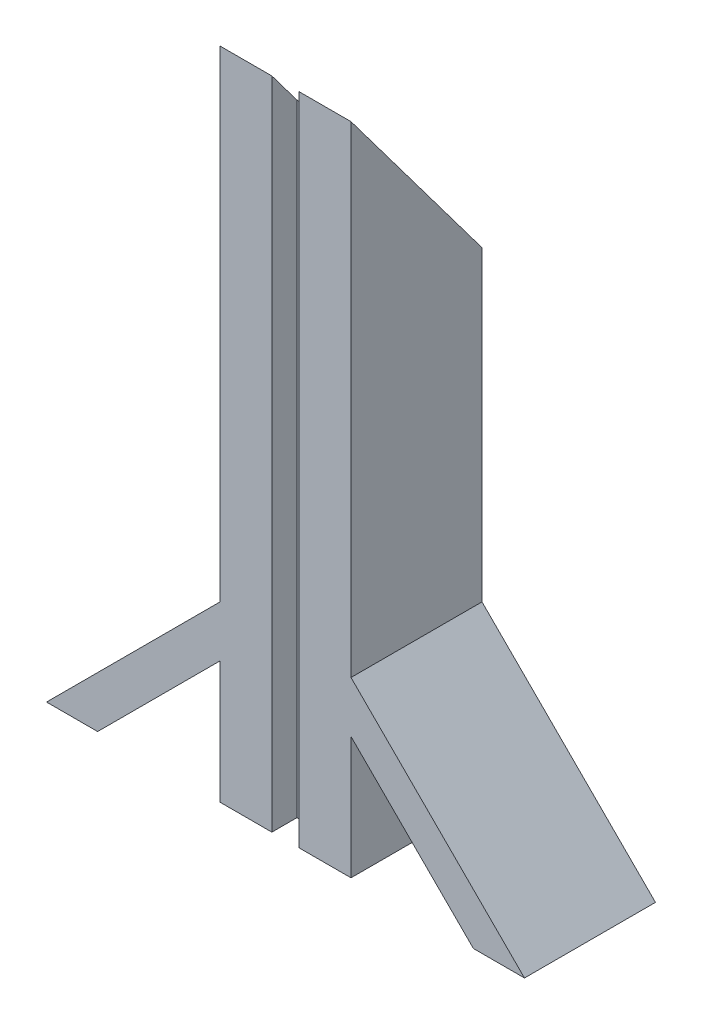
ISO-10303-21;
HEADER;
FILE_DESCRIPTION(('STEP AP214'),'2;1');
FILE_NAME('part.step','',(''),(''),'','','');
FILE_SCHEMA(('AUTOMOTIVE_DESIGN { 1 0 10303 214 1 1 1 1 }'));
ENDSEC;
DATA;
#1=APPLICATION_CONTEXT('core data for automotive mechanical design processes');
#2=APPLICATION_PROTOCOL_DEFINITION('international standard','automotive_design',2000,#1);
#3=PRODUCT_CONTEXT('',#1,'mechanical');
#4=PRODUCT('Part','Part','',(#3));
#5=PRODUCT_RELATED_PRODUCT_CATEGORY('part','',(#4));
#6=PRODUCT_DEFINITION_FORMATION('','',#4);
#7=PRODUCT_DEFINITION_CONTEXT('part definition',#1,'design');
#8=PRODUCT_DEFINITION('design','',#6,#7);
#9=PRODUCT_DEFINITION_SHAPE('','',#8);
#10=(LENGTH_UNIT() NAMED_UNIT(*) SI_UNIT(.MILLI.,.METRE.));
#11=(NAMED_UNIT(*) PLANE_ANGLE_UNIT() SI_UNIT($,.RADIAN.));
#12=(NAMED_UNIT(*) SI_UNIT($,.STERADIAN.) SOLID_ANGLE_UNIT());
#13=UNCERTAINTY_MEASURE_WITH_UNIT(LENGTH_MEASURE(1.E-05),#10,'distance_accuracy_value','');
#14=(GEOMETRIC_REPRESENTATION_CONTEXT(3) GLOBAL_UNCERTAINTY_ASSIGNED_CONTEXT((#13)) GLOBAL_UNIT_ASSIGNED_CONTEXT((#10,
#11,#12)) REPRESENTATION_CONTEXT('',''));
#15=CARTESIAN_POINT('',(0.,0.,0.));
#16=DIRECTION('',(0.,0.,1.));
#17=DIRECTION('',(1.,0.,0.));
#18=AXIS2_PLACEMENT_3D('',#15,#16,#17);
#19=CARTESIAN_POINT('',(-15.,150.,15.));
#20=DIRECTION('',(0.,0.,-1.));
#21=DIRECTION('',(-1.,0.,0.));
#22=AXIS2_PLACEMENT_3D('',#19,#20,#21);
#23=PLANE('',#22);
#24=DIRECTION('',(1.,0.,0.));
#25=VECTOR('',#24,1.);
#26=CARTESIAN_POINT('',(-15.,150.,15.));
#27=LINE('',#26,#25);
#28=CARTESIAN_POINT('',(3.125,150.,15.));
#29=VERTEX_POINT('',#28);
#30=CARTESIAN_POINT('',(15.,150.,15.));
#31=VERTEX_POINT('',#30);
#32=EDGE_CURVE('E238',#29,#31,#27,.T.);
#33=ORIENTED_EDGE('',*,*,#32,.F.);
#34=DIRECTION('',(0.,-1.,0.));
#35=VECTOR('',#34,1.);
#36=CARTESIAN_POINT('',(3.125,150.,15.));
#37=LINE('',#36,#35);
#38=CARTESIAN_POINT('',(3.125,0.,15.));
#39=VERTEX_POINT('',#38);
#40=EDGE_CURVE('E173',#29,#39,#37,.T.);
#41=ORIENTED_EDGE('',*,*,#40,.T.);
#42=DIRECTION('',(1.,0.,0.));
#43=VECTOR('',#42,1.);
#44=CARTESIAN_POINT('',(-15.,0.,15.));
#45=LINE('',#44,#43);
#46=CARTESIAN_POINT('',(15.,0.,15.));
#47=VERTEX_POINT('',#46);
#48=EDGE_CURVE('E247',#39,#47,#45,.T.);
#49=ORIENTED_EDGE('',*,*,#48,.T.);
#50=DIRECTION('',(0.,-1.,0.));
#51=VECTOR('',#50,1.);
#52=CARTESIAN_POINT('',(15.,150.,15.));
#53=LINE('',#52,#51);
#54=CARTESIAN_POINT('',(15.,28.0338173946939,15.));
#55=VERTEX_POINT('',#54);
#56=EDGE_CURVE('E237',#55,#47,#53,.T.);
#57=ORIENTED_EDGE('',*,*,#56,.F.);
#58=DIRECTION('',(-0.707106781186544,0.707106781186551,0.));
#59=VECTOR('',#58,1.);
#60=CARTESIAN_POINT('',(43.0338173946936,0.,15.));
#61=LINE('',#60,#59);
#62=CARTESIAN_POINT('',(43.0338173946936,0.,15.));
#63=VERTEX_POINT('',#62);
#64=EDGE_CURVE('E220',#63,#55,#61,.T.);
#65=ORIENTED_EDGE('',*,*,#64,.F.);
#66=DIRECTION('',(-1.,0.,0.));
#67=VECTOR('',#66,1.);
#68=CARTESIAN_POINT('',(54.7364332317221,0.,15.));
#69=LINE('',#68,#67);
#70=CARTESIAN_POINT('',(54.7364332317221,0.,15.));
#71=VERTEX_POINT('',#70);
#72=EDGE_CURVE('E217',#71,#63,#69,.T.);
#73=ORIENTED_EDGE('',*,*,#72,.F.);
#74=DIRECTION('',(0.707106781186544,-0.707106781186551,0.));
#75=VECTOR('',#74,1.);
#76=CARTESIAN_POINT('',(15.,39.7364332317225,15.));
#77=LINE('',#76,#75);
#78=CARTESIAN_POINT('',(15.,39.7364332317225,15.));
#79=VERTEX_POINT('',#78);
#80=EDGE_CURVE('E221',#79,#71,#77,.T.);
#81=ORIENTED_EDGE('',*,*,#80,.F.);
#82=EDGE_CURVE('E250',#31,#79,#53,.T.);
#83=ORIENTED_EDGE('',*,*,#82,.F.);
#84=EDGE_LOOP('',(#33,#41,#49,#57,#65,#73,#81,#83));
#85=FACE_BOUND('',#84,.T.);
#86=ADVANCED_FACE('F35',(#85),#23,.F.);
#87=CARTESIAN_POINT('',(-15.,150.,15.));
#88=DIRECTION('',(1.,0.,0.));
#89=DIRECTION('',(0.,0.,-1.));
#90=AXIS2_PLACEMENT_3D('',#87,#88,#89);
#91=PLANE('',#90);
#92=DIRECTION('',(0.,-1.,0.));
#93=VECTOR('',#92,1.);
#94=CARTESIAN_POINT('',(-15.,150.,15.));
#95=LINE('',#94,#93);
#96=CARTESIAN_POINT('',(-15.,150.,15.));
#97=VERTEX_POINT('',#96);
#98=CARTESIAN_POINT('',(-15.,39.7364332317225,15.));
#99=VERTEX_POINT('',#98);
#100=EDGE_CURVE('E254',#97,#99,#95,.T.);
#101=ORIENTED_EDGE('',*,*,#100,.F.);
#102=DIRECTION('',(0.,0.8,0.6));
#103=VECTOR('',#102,1.);
#104=CARTESIAN_POINT('',(-15.,150.,15.));
#105=LINE('',#104,#103);
#106=CARTESIAN_POINT('',(-15.,110.,-15.));
#107=VERTEX_POINT('',#106);
#108=EDGE_CURVE('E176',#107,#97,#105,.T.);
#109=ORIENTED_EDGE('',*,*,#108,.F.);
#110=DIRECTION('',(0.,-1.,0.));
#111=VECTOR('',#110,1.);
#112=CARTESIAN_POINT('',(-15.,150.,-15.));
#113=LINE('',#112,#111);
#114=CARTESIAN_POINT('',(-15.,39.7364332317225,-15.));
#115=VERTEX_POINT('',#114);
#116=EDGE_CURVE('E258',#107,#115,#113,.T.);
#117=ORIENTED_EDGE('',*,*,#116,.T.);
#118=DIRECTION('',(0.,0.,-1.));
#119=VECTOR('',#118,1.);
#120=CARTESIAN_POINT('',(-15.,39.7364332317225,71.1958027966347));
#121=LINE('',#120,#119);
#122=EDGE_CURVE('E195',#99,#115,#121,.T.);
#123=ORIENTED_EDGE('',*,*,#122,.F.);
#124=EDGE_LOOP('',(#101,#109,#117,#123));
#125=FACE_BOUND('',#124,.T.);
#126=ADVANCED_FACE('F300',(#125),#91,.F.);
#127=CARTESIAN_POINT('',(15.,150.,15.));
#128=DIRECTION('',(-1.,0.,0.));
#129=DIRECTION('',(0.,0.,1.));
#130=AXIS2_PLACEMENT_3D('',#127,#128,#129);
#131=PLANE('',#130);
#132=DIRECTION('',(0.,0.,-1.));
#133=VECTOR('',#132,1.);
#134=CARTESIAN_POINT('',(15.,28.0338173946939,71.1958027966346));
#135=LINE('',#134,#133);
#136=CARTESIAN_POINT('',(15.,28.0338173946939,-15.));
#137=VERTEX_POINT('',#136);
#138=EDGE_CURVE('E230',#55,#137,#135,.T.);
#139=ORIENTED_EDGE('',*,*,#138,.F.);
#140=ORIENTED_EDGE('',*,*,#56,.T.);
#141=DIRECTION('',(0.,0.,-1.));
#142=VECTOR('',#141,1.);
#143=CARTESIAN_POINT('',(15.,0.,15.));
#144=LINE('',#143,#142);
#145=CARTESIAN_POINT('',(15.,0.,-15.));
#146=VERTEX_POINT('',#145);
#147=EDGE_CURVE('E223',#47,#146,#144,.T.);
#148=ORIENTED_EDGE('',*,*,#147,.T.);
#149=DIRECTION('',(0.,-1.,0.));
#150=VECTOR('',#149,1.);
#151=CARTESIAN_POINT('',(15.,150.,-15.));
#152=LINE('',#151,#150);
#153=EDGE_CURVE('E260',#137,#146,#152,.T.);
#154=ORIENTED_EDGE('',*,*,#153,.F.);
#155=EDGE_LOOP('',(#139,#140,#148,#154));
#156=FACE_BOUND('',#155,.T.);
#157=ADVANCED_FACE('F282',(#156),#131,.F.);
#158=CARTESIAN_POINT('',(15.,110.,-15.));
#159=VERTEX_POINT('',#158);
#160=CARTESIAN_POINT('',(15.,39.7364332317225,-15.));
#161=VERTEX_POINT('',#160);
#162=EDGE_CURVE('E261',#159,#161,#152,.T.);
#163=ORIENTED_EDGE('',*,*,#162,.F.);
#164=DIRECTION('',(0.,0.8,0.6));
#165=VECTOR('',#164,1.);
#166=CARTESIAN_POINT('',(15.,150.,15.));
#167=LINE('',#166,#165);
#168=EDGE_CURVE('E180',#159,#31,#167,.T.);
#169=ORIENTED_EDGE('',*,*,#168,.T.);
#170=ORIENTED_EDGE('',*,*,#82,.T.);
#171=DIRECTION('',(0.,0.,-1.));
#172=VECTOR('',#171,1.);
#173=CARTESIAN_POINT('',(15.,39.7364332317225,71.1958027966346));
#174=LINE('',#173,#172);
#175=EDGE_CURVE('E216',#79,#161,#174,.T.);
#176=ORIENTED_EDGE('',*,*,#175,.T.);
#177=EDGE_LOOP('',(#163,#169,#170,#176));
#178=FACE_BOUND('',#177,.T.);
#179=ADVANCED_FACE('F37',(#178),#131,.F.);
#180=CARTESIAN_POINT('',(-15.,150.,-15.));
#181=DIRECTION('',(0.,0.,1.));
#182=DIRECTION('',(1.,0.,0.));
#183=AXIS2_PLACEMENT_3D('',#180,#181,#182);
#184=PLANE('',#183);
#185=ORIENTED_EDGE('',*,*,#116,.F.);
#186=DIRECTION('',(-1.,0.,0.));
#187=VECTOR('',#186,1.);
#188=CARTESIAN_POINT('',(54.7364332317221,110.,-15.));
#189=LINE('',#188,#187);
#190=EDGE_CURVE('E178',#159,#107,#189,.T.);
#191=ORIENTED_EDGE('',*,*,#190,.F.);
#192=ORIENTED_EDGE('',*,*,#162,.T.);
#193=DIRECTION('',(0.707106781186544,-0.707106781186551,0.));
#194=VECTOR('',#193,1.);
#195=CARTESIAN_POINT('',(15.,39.7364332317225,-15.));
#196=LINE('',#195,#194);
#197=CARTESIAN_POINT('',(54.7364332317221,0.,-15.));
#198=VERTEX_POINT('',#197);
#199=EDGE_CURVE('E210',#161,#198,#196,.T.);
#200=ORIENTED_EDGE('',*,*,#199,.T.);
#201=DIRECTION('',(-1.,0.,0.));
#202=VECTOR('',#201,1.);
#203=CARTESIAN_POINT('',(54.7364332317221,0.,-15.));
#204=LINE('',#203,#202);
#205=CARTESIAN_POINT('',(43.0338173946936,0.,-15.));
#206=VERTEX_POINT('',#205);
#207=EDGE_CURVE('E207',#198,#206,#204,.T.);
#208=ORIENTED_EDGE('',*,*,#207,.T.);
#209=DIRECTION('',(-0.707106781186544,0.707106781186551,0.));
#210=VECTOR('',#209,1.);
#211=CARTESIAN_POINT('',(43.0338173946936,0.,-15.));
#212=LINE('',#211,#210);
#213=EDGE_CURVE('E213',#206,#137,#212,.T.);
#214=ORIENTED_EDGE('',*,*,#213,.T.);
#215=ORIENTED_EDGE('',*,*,#153,.T.);
#216=DIRECTION('',(-1.,0.,0.));
#217=VECTOR('',#216,1.);
#218=CARTESIAN_POINT('',(-15.,0.,-15.));
#219=LINE('',#218,#217);
#220=CARTESIAN_POINT('',(-15.,0.,-15.));
#221=VERTEX_POINT('',#220);
#222=EDGE_CURVE('E241',#146,#221,#219,.T.);
#223=ORIENTED_EDGE('',*,*,#222,.T.);
#224=CARTESIAN_POINT('',(-15.,28.0338173946939,-15.));
#225=VERTEX_POINT('',#224);
#226=EDGE_CURVE('E257',#225,#221,#113,.T.);
#227=ORIENTED_EDGE('',*,*,#226,.F.);
#228=DIRECTION('',(0.707106781186544,0.707106781186551,0.));
#229=VECTOR('',#228,1.);
#230=CARTESIAN_POINT('',(-43.0338173946936,0.,-15.));
#231=LINE('',#230,#229);
#232=CARTESIAN_POINT('',(-43.0338173946936,0.,-15.));
#233=VERTEX_POINT('',#232);
#234=EDGE_CURVE('E187',#233,#225,#231,.T.);
#235=ORIENTED_EDGE('',*,*,#234,.F.);
#236=DIRECTION('',(1.,0.,0.));
#237=VECTOR('',#236,1.);
#238=CARTESIAN_POINT('',(-54.7364332317221,0.,-15.));
#239=LINE('',#238,#237);
#240=CARTESIAN_POINT('',(-54.7364332317221,0.,-15.));
#241=VERTEX_POINT('',#240);
#242=EDGE_CURVE('E184',#241,#233,#239,.T.);
#243=ORIENTED_EDGE('',*,*,#242,.F.);
#244=DIRECTION('',(-0.707106781186544,-0.707106781186551,0.));
#245=VECTOR('',#244,1.);
#246=CARTESIAN_POINT('',(-15.,39.7364332317225,-15.));
#247=LINE('',#246,#245);
#248=EDGE_CURVE('E183',#115,#241,#247,.T.);
#249=ORIENTED_EDGE('',*,*,#248,.F.);
#250=EDGE_LOOP('',(#185,#191,#192,#200,#208,#214,#215,#223,#227,#235,#243,#249));
#251=FACE_BOUND('',#250,.T.);
#252=ADVANCED_FACE('F277',(#251),#184,.F.);
#253=CARTESIAN_POINT('',(-15.,28.0338173946939,15.));
#254=VERTEX_POINT('',#253);
#255=CARTESIAN_POINT('',(-15.,0.,15.));
#256=VERTEX_POINT('',#255);
#257=EDGE_CURVE('E253',#254,#256,#95,.T.);
#258=ORIENTED_EDGE('',*,*,#257,.F.);
#259=DIRECTION('',(0.,0.,-1.));
#260=VECTOR('',#259,1.);
#261=CARTESIAN_POINT('',(-15.,28.0338173946939,71.1958027966347));
#262=LINE('',#261,#260);
#263=EDGE_CURVE('E58',#254,#225,#262,.T.);
#264=ORIENTED_EDGE('',*,*,#263,.T.);
#265=ORIENTED_EDGE('',*,*,#226,.T.);
#266=DIRECTION('',(0.,0.,1.));
#267=VECTOR('',#266,1.);
#268=CARTESIAN_POINT('',(-15.,0.,15.));
#269=LINE('',#268,#267);
#270=EDGE_CURVE('E244',#221,#256,#269,.T.);
#271=ORIENTED_EDGE('',*,*,#270,.T.);
#272=EDGE_LOOP('',(#258,#264,#265,#271));
#273=FACE_BOUND('',#272,.T.);
#274=ADVANCED_FACE('F273',(#273),#91,.F.);
#275=CARTESIAN_POINT('',(-3.125,0.,15.));
#276=VERTEX_POINT('',#275);
#277=EDGE_CURVE('E248',#256,#276,#45,.T.);
#278=ORIENTED_EDGE('',*,*,#277,.T.);
#279=DIRECTION('',(0.,1.,0.));
#280=VECTOR('',#279,1.);
#281=CARTESIAN_POINT('',(-3.125,150.,15.));
#282=LINE('',#281,#280);
#283=CARTESIAN_POINT('',(-3.125,150.,15.));
#284=VERTEX_POINT('',#283);
#285=EDGE_CURVE('E160',#276,#284,#282,.T.);
#286=ORIENTED_EDGE('',*,*,#285,.T.);
#287=EDGE_CURVE('E234',#97,#284,#27,.T.);
#288=ORIENTED_EDGE('',*,*,#287,.F.);
#289=ORIENTED_EDGE('',*,*,#100,.T.);
#290=DIRECTION('',(-0.707106781186544,-0.707106781186551,0.));
#291=VECTOR('',#290,1.);
#292=CARTESIAN_POINT('',(-15.,39.7364332317225,15.));
#293=LINE('',#292,#291);
#294=CARTESIAN_POINT('',(-54.7364332317221,0.,15.));
#295=VERTEX_POINT('',#294);
#296=EDGE_CURVE('E194',#99,#295,#293,.T.);
#297=ORIENTED_EDGE('',*,*,#296,.T.);
#298=DIRECTION('',(1.,0.,0.));
#299=VECTOR('',#298,1.);
#300=CARTESIAN_POINT('',(-54.7364332317221,0.,15.));
#301=LINE('',#300,#299);
#302=CARTESIAN_POINT('',(-43.0338173946936,0.,15.));
#303=VERTEX_POINT('',#302);
#304=EDGE_CURVE('E192',#295,#303,#301,.T.);
#305=ORIENTED_EDGE('',*,*,#304,.T.);
#306=DIRECTION('',(0.707106781186544,0.707106781186551,0.));
#307=VECTOR('',#306,1.);
#308=CARTESIAN_POINT('',(-43.0338173946936,0.,15.));
#309=LINE('',#308,#307);
#310=EDGE_CURVE('E197',#303,#254,#309,.T.);
#311=ORIENTED_EDGE('',*,*,#310,.T.);
#312=ORIENTED_EDGE('',*,*,#257,.T.);
#313=EDGE_LOOP('',(#278,#286,#288,#289,#297,#305,#311,#312));
#314=FACE_BOUND('',#313,.T.);
#315=ADVANCED_FACE('F269',(#314),#23,.F.);
#316=CARTESIAN_POINT('',(0.,0.,0.));
#317=DIRECTION('',(0.,-1.,0.));
#318=DIRECTION('',(0.,0.,-1.));
#319=AXIS2_PLACEMENT_3D('',#316,#317,#318);
#320=PLANE('',#319);
#321=DIRECTION('',(0.,0.,1.));
#322=VECTOR('',#321,1.);
#323=CARTESIAN_POINT('',(3.125,0.,20.7227764894021));
#324=LINE('',#323,#322);
#325=CARTESIAN_POINT('',(3.125,0.,9.27722351059787));
#326=VERTEX_POINT('',#325);
#327=EDGE_CURVE('E164',#326,#39,#324,.T.);
#328=ORIENTED_EDGE('',*,*,#327,.F.);
#329=DIRECTION('',(1.,0.,0.));
#330=VECTOR('',#329,1.);
#331=CARTESIAN_POINT('',(-3.125,0.,9.27722351059787));
#332=LINE('',#331,#330);
#333=CARTESIAN_POINT('',(-3.125,0.,9.27722351059787));
#334=VERTEX_POINT('',#333);
#335=EDGE_CURVE('E150',#334,#326,#332,.T.);
#336=ORIENTED_EDGE('',*,*,#335,.F.);
#337=DIRECTION('',(0.,0.,-1.));
#338=VECTOR('',#337,1.);
#339=CARTESIAN_POINT('',(-3.125,0.,20.7227764894021));
#340=LINE('',#339,#338);
#341=EDGE_CURVE('E157',#276,#334,#340,.T.);
#342=ORIENTED_EDGE('',*,*,#341,.F.);
#343=ORIENTED_EDGE('',*,*,#277,.F.);
#344=ORIENTED_EDGE('',*,*,#270,.F.);
#345=ORIENTED_EDGE('',*,*,#222,.F.);
#346=ORIENTED_EDGE('',*,*,#147,.F.);
#347=ORIENTED_EDGE('',*,*,#48,.F.);
#348=EDGE_LOOP('',(#328,#336,#342,#343,#344,#345,#346,#347));
#349=FACE_BOUND('',#348,.T.);
#350=ADVANCED_FACE('F166',(#349),#320,.T.);
#351=CARTESIAN_POINT('',(15.,39.7364332317225,71.1958027966346));
#352=DIRECTION('',(-0.707106781186551,-0.707106781186544,0.));
#353=DIRECTION('',(0.707106781186544,-0.707106781186551,0.));
#354=AXIS2_PLACEMENT_3D('',#351,#352,#353);
#355=PLANE('',#354);
#356=ORIENTED_EDGE('',*,*,#175,.F.);
#357=ORIENTED_EDGE('',*,*,#80,.T.);
#358=DIRECTION('',(0.,0.,-1.));
#359=VECTOR('',#358,1.);
#360=CARTESIAN_POINT('',(54.7364332317221,0.,71.1958027966346));
#361=LINE('',#360,#359);
#362=EDGE_CURVE('E226',#71,#198,#361,.T.);
#363=ORIENTED_EDGE('',*,*,#362,.T.);
#364=ORIENTED_EDGE('',*,*,#199,.F.);
#365=EDGE_LOOP('',(#356,#357,#363,#364));
#366=FACE_BOUND('',#365,.T.);
#367=ADVANCED_FACE('F313',(#366),#355,.F.);
#368=CARTESIAN_POINT('',(54.7364332317221,0.,71.1958027966346));
#369=DIRECTION('',(0.,1.,0.));
#370=DIRECTION('',(-1.,0.,0.));
#371=AXIS2_PLACEMENT_3D('',#368,#369,#370);
#372=PLANE('',#371);
#373=ORIENTED_EDGE('',*,*,#362,.F.);
#374=ORIENTED_EDGE('',*,*,#72,.T.);
#375=DIRECTION('',(0.,0.,-1.));
#376=VECTOR('',#375,1.);
#377=CARTESIAN_POINT('',(43.0338173946936,0.,71.1958027966346));
#378=LINE('',#377,#376);
#379=EDGE_CURVE('E228',#63,#206,#378,.T.);
#380=ORIENTED_EDGE('',*,*,#379,.T.);
#381=ORIENTED_EDGE('',*,*,#207,.F.);
#382=EDGE_LOOP('',(#373,#374,#380,#381));
#383=FACE_BOUND('',#382,.T.);
#384=ADVANCED_FACE('F332',(#383),#372,.F.);
#385=CARTESIAN_POINT('',(43.0338173946936,0.,71.1958027966346));
#386=DIRECTION('',(0.707106781186551,0.707106781186544,0.));
#387=DIRECTION('',(-0.707106781186544,0.707106781186551,0.));
#388=AXIS2_PLACEMENT_3D('',#385,#386,#387);
#389=PLANE('',#388);
#390=ORIENTED_EDGE('',*,*,#379,.F.);
#391=ORIENTED_EDGE('',*,*,#64,.T.);
#392=ORIENTED_EDGE('',*,*,#138,.T.);
#393=ORIENTED_EDGE('',*,*,#213,.F.);
#394=EDGE_LOOP('',(#390,#391,#392,#393));
#395=FACE_BOUND('',#394,.T.);
#396=ADVANCED_FACE('F335',(#395),#389,.F.);
#397=CARTESIAN_POINT('',(-15.,39.7364332317225,71.1958027966347));
#398=DIRECTION('',(-0.707106781186551,0.707106781186544,0.));
#399=DIRECTION('',(-0.707106781186544,-0.707106781186551,0.));
#400=AXIS2_PLACEMENT_3D('',#397,#398,#399);
#401=PLANE('',#400);
#402=ORIENTED_EDGE('',*,*,#296,.F.);
#403=ORIENTED_EDGE('',*,*,#122,.T.);
#404=ORIENTED_EDGE('',*,*,#248,.T.);
#405=DIRECTION('',(0.,0.,-1.));
#406=VECTOR('',#405,1.);
#407=CARTESIAN_POINT('',(-54.7364332317221,0.,71.1958027966347));
#408=LINE('',#407,#406);
#409=EDGE_CURVE('E201',#295,#241,#408,.T.);
#410=ORIENTED_EDGE('',*,*,#409,.F.);
#411=EDGE_LOOP('',(#402,#403,#404,#410));
#412=FACE_BOUND('',#411,.T.);
#413=ADVANCED_FACE('F337',(#412),#401,.T.);
#414=CARTESIAN_POINT('',(-54.7364332317221,0.,71.1958027966347));
#415=DIRECTION('',(0.,-1.,0.));
#416=DIRECTION('',(1.,0.,0.));
#417=AXIS2_PLACEMENT_3D('',#414,#415,#416);
#418=PLANE('',#417);
#419=ORIENTED_EDGE('',*,*,#304,.F.);
#420=ORIENTED_EDGE('',*,*,#409,.T.);
#421=ORIENTED_EDGE('',*,*,#242,.T.);
#422=DIRECTION('',(0.,0.,-1.));
#423=VECTOR('',#422,1.);
#424=CARTESIAN_POINT('',(-43.0338173946936,0.,71.1958027966347));
#425=LINE('',#424,#423);
#426=EDGE_CURVE('E199',#303,#233,#425,.T.);
#427=ORIENTED_EDGE('',*,*,#426,.F.);
#428=EDGE_LOOP('',(#419,#420,#421,#427));
#429=FACE_BOUND('',#428,.T.);
#430=ADVANCED_FACE('F343',(#429),#418,.T.);
#431=CARTESIAN_POINT('',(-43.0338173946936,0.,71.1958027966347));
#432=DIRECTION('',(0.707106781186551,-0.707106781186544,0.));
#433=DIRECTION('',(0.707106781186544,0.707106781186551,0.));
#434=AXIS2_PLACEMENT_3D('',#431,#432,#433);
#435=PLANE('',#434);
#436=ORIENTED_EDGE('',*,*,#310,.F.);
#437=ORIENTED_EDGE('',*,*,#426,.T.);
#438=ORIENTED_EDGE('',*,*,#234,.T.);
#439=ORIENTED_EDGE('',*,*,#263,.F.);
#440=EDGE_LOOP('',(#436,#437,#438,#439));
#441=FACE_BOUND('',#440,.T.);
#442=ADVANCED_FACE('F296',(#441),#435,.T.);
#443=CARTESIAN_POINT('',(54.7364332317221,150.,15.));
#444=DIRECTION('',(0.,-0.6,0.8));
#445=DIRECTION('',(0.,-0.8,-0.6));
#446=AXIS2_PLACEMENT_3D('',#443,#444,#445);
#447=PLANE('',#446);
#448=DIRECTION('',(1.,0.,0.));
#449=VECTOR('',#448,1.);
#450=CARTESIAN_POINT('',(54.7364332317221,142.369631347464,9.27722351059786));
#451=LINE('',#450,#449);
#452=CARTESIAN_POINT('',(-3.125,142.369631347464,9.27722351059786));
#453=VERTEX_POINT('',#452);
#454=CARTESIAN_POINT('',(3.125,142.369631347464,9.27722351059787));
#455=VERTEX_POINT('',#454);
#456=EDGE_CURVE('E43',#453,#455,#451,.T.);
#457=ORIENTED_EDGE('',*,*,#456,.T.);
#458=DIRECTION('',(0.,0.8,0.6));
#459=VECTOR('',#458,1.);
#460=CARTESIAN_POINT('',(3.125,150.,15.));
#461=LINE('',#460,#459);
#462=EDGE_CURVE('E11',#455,#29,#461,.T.);
#463=ORIENTED_EDGE('',*,*,#462,.T.);
#464=ORIENTED_EDGE('',*,*,#32,.T.);
#465=ORIENTED_EDGE('',*,*,#168,.F.);
#466=ORIENTED_EDGE('',*,*,#190,.T.);
#467=ORIENTED_EDGE('',*,*,#108,.T.);
#468=ORIENTED_EDGE('',*,*,#287,.T.);
#469=DIRECTION('',(0.,-0.8,-0.6));
#470=VECTOR('',#469,1.);
#471=CARTESIAN_POINT('',(-3.125,150.,15.));
#472=LINE('',#471,#470);
#473=EDGE_CURVE('E263',#284,#453,#472,.T.);
#474=ORIENTED_EDGE('',*,*,#473,.T.);
#475=EDGE_LOOP('',(#457,#463,#464,#465,#466,#467,#468,#474));
#476=FACE_BOUND('',#475,.T.);
#477=ADVANCED_FACE('F265',(#476),#447,.F.);
#478=CARTESIAN_POINT('',(3.125,150.,20.7227764894021));
#479=DIRECTION('',(1.,0.,0.));
#480=DIRECTION('',(0.,0.,-1.));
#481=AXIS2_PLACEMENT_3D('',#478,#479,#480);
#482=PLANE('',#481);
#483=ORIENTED_EDGE('',*,*,#462,.F.);
#484=DIRECTION('',(0.,-1.,0.));
#485=VECTOR('',#484,1.);
#486=CARTESIAN_POINT('',(3.125,150.,9.27722351059787));
#487=LINE('',#486,#485);
#488=EDGE_CURVE('E154',#455,#326,#487,.T.);
#489=ORIENTED_EDGE('',*,*,#488,.T.);
#490=ORIENTED_EDGE('',*,*,#327,.T.);
#491=ORIENTED_EDGE('',*,*,#40,.F.);
#492=EDGE_LOOP('',(#483,#489,#490,#491));
#493=FACE_BOUND('',#492,.T.);
#494=ADVANCED_FACE('F288',(#493),#482,.F.);
#495=CARTESIAN_POINT('',(-3.125,150.,9.27722351059787));
#496=DIRECTION('',(0.,0.,-1.));
#497=DIRECTION('',(-1.,0.,0.));
#498=AXIS2_PLACEMENT_3D('',#495,#496,#497);
#499=PLANE('',#498);
#500=DIRECTION('',(0.,-1.,0.));
#501=VECTOR('',#500,1.);
#502=CARTESIAN_POINT('',(-3.125,150.,9.27722351059787));
#503=LINE('',#502,#501);
#504=EDGE_CURVE('E50',#453,#334,#503,.T.);
#505=ORIENTED_EDGE('',*,*,#504,.T.);
#506=ORIENTED_EDGE('',*,*,#335,.T.);
#507=ORIENTED_EDGE('',*,*,#488,.F.);
#508=ORIENTED_EDGE('',*,*,#456,.F.);
#509=EDGE_LOOP('',(#505,#506,#507,#508));
#510=FACE_BOUND('',#509,.T.);
#511=ADVANCED_FACE('F147',(#510),#499,.F.);
#512=CARTESIAN_POINT('',(-3.125,150.,20.7227764894021));
#513=DIRECTION('',(-1.,0.,0.));
#514=DIRECTION('',(0.,0.,1.));
#515=AXIS2_PLACEMENT_3D('',#512,#513,#514);
#516=PLANE('',#515);
#517=ORIENTED_EDGE('',*,*,#341,.T.);
#518=ORIENTED_EDGE('',*,*,#504,.F.);
#519=ORIENTED_EDGE('',*,*,#473,.F.);
#520=ORIENTED_EDGE('',*,*,#285,.F.);
#521=EDGE_LOOP('',(#517,#518,#519,#520));
#522=FACE_BOUND('',#521,.T.);
#523=ADVANCED_FACE('F158',(#522),#516,.F.);
#524=CLOSED_SHELL('',(#86,#126,#157,#179,#252,#274,#315,#350,#367,#384,#396,#413,#430,#442,#477,
#494,#511,#523));
#525=MANIFOLD_SOLID_BREP('B2',#524);
#526=ADVANCED_BREP_SHAPE_REPRESENTATION('',(#18,#525),#14);
#527=SHAPE_DEFINITION_REPRESENTATION(#9,#526);
ENDSEC;
END-ISO-10303-21;
